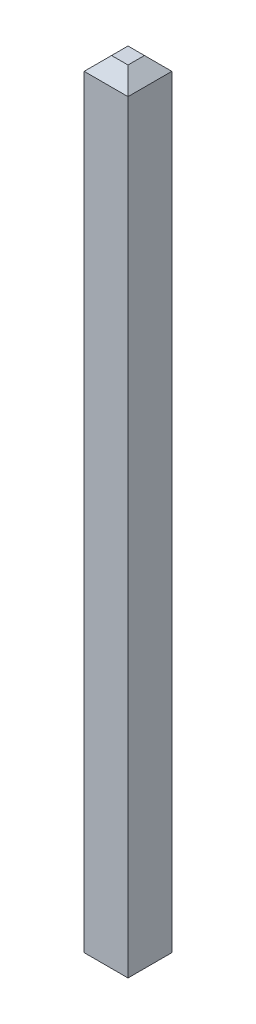
ISO-10303-21;
HEADER;
FILE_DESCRIPTION(('STEP AP214'),'2;1');
FILE_NAME('part.step','',(''),(''),'','','');
FILE_SCHEMA(('AUTOMOTIVE_DESIGN { 1 0 10303 214 1 1 1 1 }'));
ENDSEC;
DATA;
#1=APPLICATION_CONTEXT('core data for automotive mechanical design processes');
#2=APPLICATION_PROTOCOL_DEFINITION('international standard','automotive_design',2000,#1);
#3=PRODUCT_CONTEXT('',#1,'mechanical');
#4=PRODUCT('Part','Part','',(#3));
#5=PRODUCT_RELATED_PRODUCT_CATEGORY('part','',(#4));
#6=PRODUCT_DEFINITION_FORMATION('','',#4);
#7=PRODUCT_DEFINITION_CONTEXT('part definition',#1,'design');
#8=PRODUCT_DEFINITION('design','',#6,#7);
#9=PRODUCT_DEFINITION_SHAPE('','',#8);
#10=(LENGTH_UNIT() NAMED_UNIT(*) SI_UNIT(.MILLI.,.METRE.));
#11=(NAMED_UNIT(*) PLANE_ANGLE_UNIT() SI_UNIT($,.RADIAN.));
#12=(NAMED_UNIT(*) SI_UNIT($,.STERADIAN.) SOLID_ANGLE_UNIT());
#13=UNCERTAINTY_MEASURE_WITH_UNIT(LENGTH_MEASURE(1.E-05),#10,'distance_accuracy_value','');
#14=(GEOMETRIC_REPRESENTATION_CONTEXT(3) GLOBAL_UNCERTAINTY_ASSIGNED_CONTEXT((#13)) GLOBAL_UNIT_ASSIGNED_CONTEXT((#10,
#11,#12)) REPRESENTATION_CONTEXT('',''));
#15=CARTESIAN_POINT('',(0.,0.,0.));
#16=DIRECTION('',(0.,0.,1.));
#17=DIRECTION('',(1.,0.,0.));
#18=AXIS2_PLACEMENT_3D('',#15,#16,#17);
#19=CARTESIAN_POINT('',(4.13,7.07,-0.32));
#20=DIRECTION('',(-0.707106781186548,-0.707106781186548,0.));
#21=DIRECTION('',(-0.707106781186548,0.707106781186548,0.));
#22=AXIS2_PLACEMENT_3D('',#19,#20,#21);
#23=PLANE('',#22);
#24=DIRECTION('',(0.577350269189626,-0.577350269189626,0.577350269189626));
#25=VECTOR('',#24,1.);
#26=CARTESIAN_POINT('',(3.916666666667,7.283333333333,0.106666666667));
#27=LINE('',#26,#25);
#28=CARTESIAN_POINT('',(3.93,7.27,0.12));
#29=VERTEX_POINT('',#28);
#30=CARTESIAN_POINT('',(4.13,7.07,0.32));
#31=VERTEX_POINT('',#30);
#32=EDGE_CURVE('E189',#29,#31,#27,.T.);
#33=ORIENTED_EDGE('',*,*,#32,.T.);
#34=DIRECTION('',(0.,0.,1.));
#35=VECTOR('',#34,1.);
#36=CARTESIAN_POINT('',(4.13,7.07,-0.32));
#37=LINE('',#36,#35);
#38=CARTESIAN_POINT('',(4.13,7.07,-0.32));
#39=VERTEX_POINT('',#38);
#40=EDGE_CURVE('E20',#39,#31,#37,.T.);
#41=ORIENTED_EDGE('',*,*,#40,.F.);
#42=DIRECTION('',(0.577350269189626,-0.577350269189626,-0.577350269189626));
#43=VECTOR('',#42,1.);
#44=CARTESIAN_POINT('',(4.13,7.07,-0.32));
#45=LINE('',#44,#43);
#46=CARTESIAN_POINT('',(3.93,7.27,-0.12));
#47=VERTEX_POINT('',#46);
#48=EDGE_CURVE('E11',#47,#39,#45,.T.);
#49=ORIENTED_EDGE('',*,*,#48,.F.);
#50=DIRECTION('',(0.,0.,-1.));
#51=VECTOR('',#50,1.);
#52=CARTESIAN_POINT('',(3.93,7.27,-0.32));
#53=LINE('',#52,#51);
#54=EDGE_CURVE('E159',#29,#47,#53,.T.);
#55=ORIENTED_EDGE('',*,*,#54,.F.);
#56=EDGE_LOOP('',(#33,#41,#49,#55));
#57=FACE_BOUND('',#56,.T.);
#58=ADVANCED_FACE('F16',(#57),#23,.F.);
#59=CARTESIAN_POINT('',(3.81,7.07,-0.32));
#60=DIRECTION('',(0.,0.707106781186548,-0.707106781186548));
#61=DIRECTION('',(-1.,0.,0.));
#62=AXIS2_PLACEMENT_3D('',#59,#60,#61);
#63=PLANE('',#62);
#64=DIRECTION('',(0.577350269189626,0.577350269189626,0.577350269189626));
#65=VECTOR('',#64,1.);
#66=CARTESIAN_POINT('',(3.623333333333,7.203333333333,-0.186666666667));
#67=LINE('',#66,#65);
#68=CARTESIAN_POINT('',(3.49,7.07,-0.32));
#69=VERTEX_POINT('',#68);
#70=CARTESIAN_POINT('',(3.69,7.27,-0.12));
#71=VERTEX_POINT('',#70);
#72=EDGE_CURVE('E27',#69,#71,#67,.T.);
#73=ORIENTED_EDGE('',*,*,#72,.T.);
#74=DIRECTION('',(-1.,0.,0.));
#75=VECTOR('',#74,1.);
#76=CARTESIAN_POINT('',(3.49,7.27,-0.12));
#77=LINE('',#76,#75);
#78=EDGE_CURVE('E163',#47,#71,#77,.T.);
#79=ORIENTED_EDGE('',*,*,#78,.F.);
#80=ORIENTED_EDGE('',*,*,#48,.T.);
#81=DIRECTION('',(1.,0.,0.));
#82=VECTOR('',#81,1.);
#83=CARTESIAN_POINT('',(4.13,7.07,-0.32));
#84=LINE('',#83,#82);
#85=EDGE_CURVE('E153',#69,#39,#84,.T.);
#86=ORIENTED_EDGE('',*,*,#85,.F.);
#87=EDGE_LOOP('',(#73,#79,#80,#86));
#88=FACE_BOUND('',#87,.T.);
#89=ADVANCED_FACE('F216',(#88),#63,.T.);
#90=CARTESIAN_POINT('',(3.69,7.27,-0.32));
#91=DIRECTION('',(0.707106781186548,-0.707106781186548,0.));
#92=DIRECTION('',(0.,0.,-1.));
#93=AXIS2_PLACEMENT_3D('',#90,#91,#92);
#94=PLANE('',#93);
#95=DIRECTION('',(-0.577350269189626,-0.577350269189626,0.577350269189626));
#96=VECTOR('',#95,1.);
#97=CARTESIAN_POINT('',(3.623333333333,7.203333333333,0.186666666667));
#98=LINE('',#97,#96);
#99=CARTESIAN_POINT('',(3.69,7.27,0.12));
#100=VERTEX_POINT('',#99);
#101=CARTESIAN_POINT('',(3.49,7.07,0.32));
#102=VERTEX_POINT('',#101);
#103=EDGE_CURVE('E40',#100,#102,#98,.T.);
#104=ORIENTED_EDGE('',*,*,#103,.F.);
#105=DIRECTION('',(0.,0.,1.));
#106=VECTOR('',#105,1.);
#107=CARTESIAN_POINT('',(3.69,7.27,-0.32));
#108=LINE('',#107,#106);
#109=EDGE_CURVE('E190',#71,#100,#108,.T.);
#110=ORIENTED_EDGE('',*,*,#109,.F.);
#111=ORIENTED_EDGE('',*,*,#72,.F.);
#112=DIRECTION('',(0.,0.,-1.));
#113=VECTOR('',#112,1.);
#114=CARTESIAN_POINT('',(3.49,7.07,-0.32));
#115=LINE('',#114,#113);
#116=EDGE_CURVE('E170',#102,#69,#115,.T.);
#117=ORIENTED_EDGE('',*,*,#116,.F.);
#118=EDGE_LOOP('',(#104,#110,#111,#117));
#119=FACE_BOUND('',#118,.T.);
#120=ADVANCED_FACE('F18',(#119),#94,.F.);
#121=CARTESIAN_POINT('',(3.49,7.27,0.12));
#122=DIRECTION('',(0.,-0.707106781186548,-0.707106781186548));
#123=DIRECTION('',(0.,-0.707106781186548,0.707106781186548));
#124=AXIS2_PLACEMENT_3D('',#121,#122,#123);
#125=PLANE('',#124);
#126=ORIENTED_EDGE('',*,*,#32,.F.);
#127=DIRECTION('',(1.,0.,0.));
#128=VECTOR('',#127,1.);
#129=CARTESIAN_POINT('',(3.49,7.27,0.12));
#130=LINE('',#129,#128);
#131=EDGE_CURVE('E185',#100,#29,#130,.T.);
#132=ORIENTED_EDGE('',*,*,#131,.F.);
#133=ORIENTED_EDGE('',*,*,#103,.T.);
#134=DIRECTION('',(-1.,0.,0.));
#135=VECTOR('',#134,1.);
#136=CARTESIAN_POINT('',(3.81,7.07,0.32));
#137=LINE('',#136,#135);
#138=EDGE_CURVE('E146',#31,#102,#137,.T.);
#139=ORIENTED_EDGE('',*,*,#138,.F.);
#140=EDGE_LOOP('',(#126,#132,#133,#139));
#141=FACE_BOUND('',#140,.T.);
#142=ADVANCED_FACE('F236',(#141),#125,.F.);
#143=CARTESIAN_POINT('',(3.49,7.27,-0.32));
#144=DIRECTION('',(0.,-1.,0.));
#145=DIRECTION('',(0.,0.,-1.));
#146=AXIS2_PLACEMENT_3D('',#143,#144,#145);
#147=PLANE('',#146);
#148=ORIENTED_EDGE('',*,*,#54,.T.);
#149=ORIENTED_EDGE('',*,*,#78,.T.);
#150=ORIENTED_EDGE('',*,*,#109,.T.);
#151=ORIENTED_EDGE('',*,*,#131,.T.);
#152=EDGE_LOOP('',(#148,#149,#150,#151));
#153=FACE_BOUND('',#152,.T.);
#154=ADVANCED_FACE('F218',(#153),#147,.F.);
#155=CARTESIAN_POINT('',(4.13,7.27,-0.32));
#156=DIRECTION('',(-1.,0.,0.));
#157=DIRECTION('',(0.,1.,0.));
#158=AXIS2_PLACEMENT_3D('',#155,#156,#157);
#159=PLANE('',#158);
#160=DIRECTION('',(0.,-1.,0.));
#161=VECTOR('',#160,1.);
#162=CARTESIAN_POINT('',(4.13,7.27,-0.32));
#163=LINE('',#162,#161);
#164=CARTESIAN_POINT('',(4.13,-4.07,-0.32));
#165=VERTEX_POINT('',#164);
#166=EDGE_CURVE('E154',#39,#165,#163,.T.);
#167=ORIENTED_EDGE('',*,*,#166,.F.);
#168=ORIENTED_EDGE('',*,*,#40,.T.);
#169=DIRECTION('',(0.,-1.,0.));
#170=VECTOR('',#169,1.);
#171=CARTESIAN_POINT('',(4.13,7.27,0.32));
#172=LINE('',#171,#170);
#173=CARTESIAN_POINT('',(4.13,-4.07,0.32));
#174=VERTEX_POINT('',#173);
#175=EDGE_CURVE('E141',#31,#174,#172,.T.);
#176=ORIENTED_EDGE('',*,*,#175,.T.);
#177=DIRECTION('',(0.,0.,-1.));
#178=VECTOR('',#177,1.);
#179=CARTESIAN_POINT('',(4.13,-4.07,-0.32));
#180=LINE('',#179,#178);
#181=EDGE_CURVE('E139',#174,#165,#180,.T.);
#182=ORIENTED_EDGE('',*,*,#181,.T.);
#183=EDGE_LOOP('',(#167,#168,#176,#182));
#184=FACE_BOUND('',#183,.T.);
#185=ADVANCED_FACE('F226',(#184),#159,.F.);
#186=CARTESIAN_POINT('',(3.81,1.5,0.32));
#187=DIRECTION('',(0.,0.,-1.));
#188=DIRECTION('',(0.,-1.,0.));
#189=AXIS2_PLACEMENT_3D('',#186,#187,#188);
#190=PLANE('',#189);
#191=ORIENTED_EDGE('',*,*,#175,.F.);
#192=ORIENTED_EDGE('',*,*,#138,.T.);
#193=DIRECTION('',(0.,1.,0.));
#194=VECTOR('',#193,1.);
#195=CARTESIAN_POINT('',(3.49,-4.27,0.32));
#196=LINE('',#195,#194);
#197=CARTESIAN_POINT('',(3.49,-4.07,0.32));
#198=VERTEX_POINT('',#197);
#199=EDGE_CURVE('E158',#198,#102,#196,.T.);
#200=ORIENTED_EDGE('',*,*,#199,.F.);
#201=DIRECTION('',(1.,0.,0.));
#202=VECTOR('',#201,1.);
#203=CARTESIAN_POINT('',(3.81,-4.07,0.32));
#204=LINE('',#203,#202);
#205=EDGE_CURVE('E142',#198,#174,#204,.T.);
#206=ORIENTED_EDGE('',*,*,#205,.T.);
#207=EDGE_LOOP('',(#191,#192,#200,#206));
#208=FACE_BOUND('',#207,.T.);
#209=ADVANCED_FACE('F233',(#208),#190,.F.);
#210=CARTESIAN_POINT('',(3.93,-4.27,-0.32));
#211=DIRECTION('',(-0.707106781186548,0.707106781186548,0.));
#212=DIRECTION('',(0.,0.,1.));
#213=AXIS2_PLACEMENT_3D('',#210,#211,#212);
#214=PLANE('',#213);
#215=DIRECTION('',(-0.577350269189626,-0.577350269189626,0.577350269189626));
#216=VECTOR('',#215,1.);
#217=CARTESIAN_POINT('',(3.996666666667,-4.203333333333,-0.186666666667));
#218=LINE('',#217,#216);
#219=CARTESIAN_POINT('',(3.93,-4.27,-0.12));
#220=VERTEX_POINT('',#219);
#221=EDGE_CURVE('E121',#165,#220,#218,.T.);
#222=ORIENTED_EDGE('',*,*,#221,.F.);
#223=ORIENTED_EDGE('',*,*,#181,.F.);
#224=DIRECTION('',(-0.577350269189626,-0.577350269189626,-0.577350269189626));
#225=VECTOR('',#224,1.);
#226=CARTESIAN_POINT('',(3.783333333333,-4.416666666667,-0.02666666666667));
#227=LINE('',#226,#225);
#228=CARTESIAN_POINT('',(3.93,-4.27,0.12));
#229=VERTEX_POINT('',#228);
#230=EDGE_CURVE('E199',#174,#229,#227,.T.);
#231=ORIENTED_EDGE('',*,*,#230,.T.);
#232=DIRECTION('',(0.,0.,1.));
#233=VECTOR('',#232,1.);
#234=CARTESIAN_POINT('',(3.93,-4.27,-0.32));
#235=LINE('',#234,#233);
#236=EDGE_CURVE('E135',#220,#229,#235,.T.);
#237=ORIENTED_EDGE('',*,*,#236,.F.);
#238=EDGE_LOOP('',(#222,#223,#231,#237));
#239=FACE_BOUND('',#238,.T.);
#240=ADVANCED_FACE('F258',(#239),#214,.F.);
#241=CARTESIAN_POINT('',(4.13,-4.27,0.12));
#242=DIRECTION('',(0.,0.707106781186548,-0.707106781186548));
#243=DIRECTION('',(-1.,0.,0.));
#244=AXIS2_PLACEMENT_3D('',#241,#242,#243);
#245=PLANE('',#244);
#246=ORIENTED_EDGE('',*,*,#230,.F.);
#247=ORIENTED_EDGE('',*,*,#205,.F.);
#248=DIRECTION('',(-0.577350269189626,0.577350269189626,0.577350269189626));
#249=VECTOR('',#248,1.);
#250=CARTESIAN_POINT('',(3.703333333333,-4.283333333333,0.106666666667));
#251=LINE('',#250,#249);
#252=CARTESIAN_POINT('',(3.69,-4.27,0.12));
#253=VERTEX_POINT('',#252);
#254=EDGE_CURVE('E169',#253,#198,#251,.T.);
#255=ORIENTED_EDGE('',*,*,#254,.F.);
#256=DIRECTION('',(-1.,0.,0.));
#257=VECTOR('',#256,1.);
#258=CARTESIAN_POINT('',(4.13,-4.27,0.12));
#259=LINE('',#258,#257);
#260=EDGE_CURVE('E129',#229,#253,#259,.T.);
#261=ORIENTED_EDGE('',*,*,#260,.F.);
#262=EDGE_LOOP('',(#246,#247,#255,#261));
#263=FACE_BOUND('',#262,.T.);
#264=ADVANCED_FACE('F263',(#263),#245,.F.);
#265=CARTESIAN_POINT('',(3.49,-4.07,-0.32));
#266=DIRECTION('',(0.707106781186548,0.707106781186548,0.));
#267=DIRECTION('',(0.,0.,-1.));
#268=AXIS2_PLACEMENT_3D('',#265,#266,#267);
#269=PLANE('',#268);
#270=DIRECTION('',(0.577350269189626,-0.577350269189626,0.577350269189626));
#271=VECTOR('',#270,1.);
#272=CARTESIAN_POINT('',(3.596666666667,-4.176666666667,-0.213333333333));
#273=LINE('',#272,#271);
#274=CARTESIAN_POINT('',(3.49,-4.07,-0.32));
#275=VERTEX_POINT('',#274);
#276=CARTESIAN_POINT('',(3.69,-4.27,-0.12));
#277=VERTEX_POINT('',#276);
#278=EDGE_CURVE('E106',#275,#277,#273,.T.);
#279=ORIENTED_EDGE('',*,*,#278,.T.);
#280=DIRECTION('',(0.,0.,-1.));
#281=VECTOR('',#280,1.);
#282=CARTESIAN_POINT('',(3.69,-4.27,-0.32));
#283=LINE('',#282,#281);
#284=EDGE_CURVE('E110',#253,#277,#283,.T.);
#285=ORIENTED_EDGE('',*,*,#284,.F.);
#286=ORIENTED_EDGE('',*,*,#254,.T.);
#287=DIRECTION('',(0.,0.,1.));
#288=VECTOR('',#287,1.);
#289=CARTESIAN_POINT('',(3.49,-4.07,-0.32));
#290=LINE('',#289,#288);
#291=EDGE_CURVE('E100',#275,#198,#290,.T.);
#292=ORIENTED_EDGE('',*,*,#291,.F.);
#293=EDGE_LOOP('',(#279,#285,#286,#292));
#294=FACE_BOUND('',#293,.T.);
#295=ADVANCED_FACE('F108',(#294),#269,.F.);
#296=CARTESIAN_POINT('',(3.49,-4.27,-0.32));
#297=DIRECTION('',(1.,0.,0.));
#298=DIRECTION('',(0.,0.,1.));
#299=AXIS2_PLACEMENT_3D('',#296,#297,#298);
#300=PLANE('',#299);
#301=ORIENTED_EDGE('',*,*,#199,.T.);
#302=ORIENTED_EDGE('',*,*,#116,.T.);
#303=DIRECTION('',(0.,1.,0.));
#304=VECTOR('',#303,1.);
#305=CARTESIAN_POINT('',(3.49,-4.27,-0.32));
#306=LINE('',#305,#304);
#307=EDGE_CURVE('E145',#275,#69,#306,.T.);
#308=ORIENTED_EDGE('',*,*,#307,.F.);
#309=ORIENTED_EDGE('',*,*,#291,.T.);
#310=EDGE_LOOP('',(#301,#302,#308,#309));
#311=FACE_BOUND('',#310,.T.);
#312=ADVANCED_FACE('F230',(#311),#300,.F.);
#313=CARTESIAN_POINT('',(3.81,1.5,-0.32));
#314=DIRECTION('',(0.,0.,-1.));
#315=DIRECTION('',(0.,-1.,0.));
#316=AXIS2_PLACEMENT_3D('',#313,#314,#315);
#317=PLANE('',#316);
#318=ORIENTED_EDGE('',*,*,#307,.T.);
#319=ORIENTED_EDGE('',*,*,#85,.T.);
#320=ORIENTED_EDGE('',*,*,#166,.T.);
#321=DIRECTION('',(-1.,0.,0.));
#322=VECTOR('',#321,1.);
#323=CARTESIAN_POINT('',(3.49,-4.07,-0.32));
#324=LINE('',#323,#322);
#325=EDGE_CURVE('E115',#165,#275,#324,.T.);
#326=ORIENTED_EDGE('',*,*,#325,.T.);
#327=EDGE_LOOP('',(#318,#319,#320,#326));
#328=FACE_BOUND('',#327,.T.);
#329=ADVANCED_FACE('F229',(#328),#317,.T.);
#330=CARTESIAN_POINT('',(3.81,-4.07,-0.32));
#331=DIRECTION('',(0.,-0.707106781186548,-0.707106781186548));
#332=DIRECTION('',(0.,-0.707106781186548,0.707106781186548));
#333=AXIS2_PLACEMENT_3D('',#330,#331,#332);
#334=PLANE('',#333);
#335=ORIENTED_EDGE('',*,*,#278,.F.);
#336=ORIENTED_EDGE('',*,*,#325,.F.);
#337=ORIENTED_EDGE('',*,*,#221,.T.);
#338=DIRECTION('',(1.,0.,0.));
#339=VECTOR('',#338,1.);
#340=CARTESIAN_POINT('',(4.13,-4.27,-0.12));
#341=LINE('',#340,#339);
#342=EDGE_CURVE('E116',#277,#220,#341,.T.);
#343=ORIENTED_EDGE('',*,*,#342,.F.);
#344=EDGE_LOOP('',(#335,#336,#337,#343));
#345=FACE_BOUND('',#344,.T.);
#346=ADVANCED_FACE('F119',(#345),#334,.T.);
#347=CARTESIAN_POINT('',(4.13,-4.27,-0.32));
#348=DIRECTION('',(0.,1.,0.));
#349=DIRECTION('',(0.,0.,-1.));
#350=AXIS2_PLACEMENT_3D('',#347,#348,#349);
#351=PLANE('',#350);
#352=ORIENTED_EDGE('',*,*,#236,.T.);
#353=ORIENTED_EDGE('',*,*,#260,.T.);
#354=ORIENTED_EDGE('',*,*,#284,.T.);
#355=ORIENTED_EDGE('',*,*,#342,.T.);
#356=EDGE_LOOP('',(#352,#353,#354,#355));
#357=FACE_BOUND('',#356,.T.);
#358=ADVANCED_FACE('F127',(#357),#351,.F.);
#359=CLOSED_SHELL('',(#58,#89,#120,#142,#154,#185,#209,#240,#264,#295,#312,#329,#346,#358));
#360=MANIFOLD_SOLID_BREP('B1',#359);
#361=ADVANCED_BREP_SHAPE_REPRESENTATION('',(#18,#360),#14);
#362=SHAPE_DEFINITION_REPRESENTATION(#9,#361);
ENDSEC;
END-ISO-10303-21;
